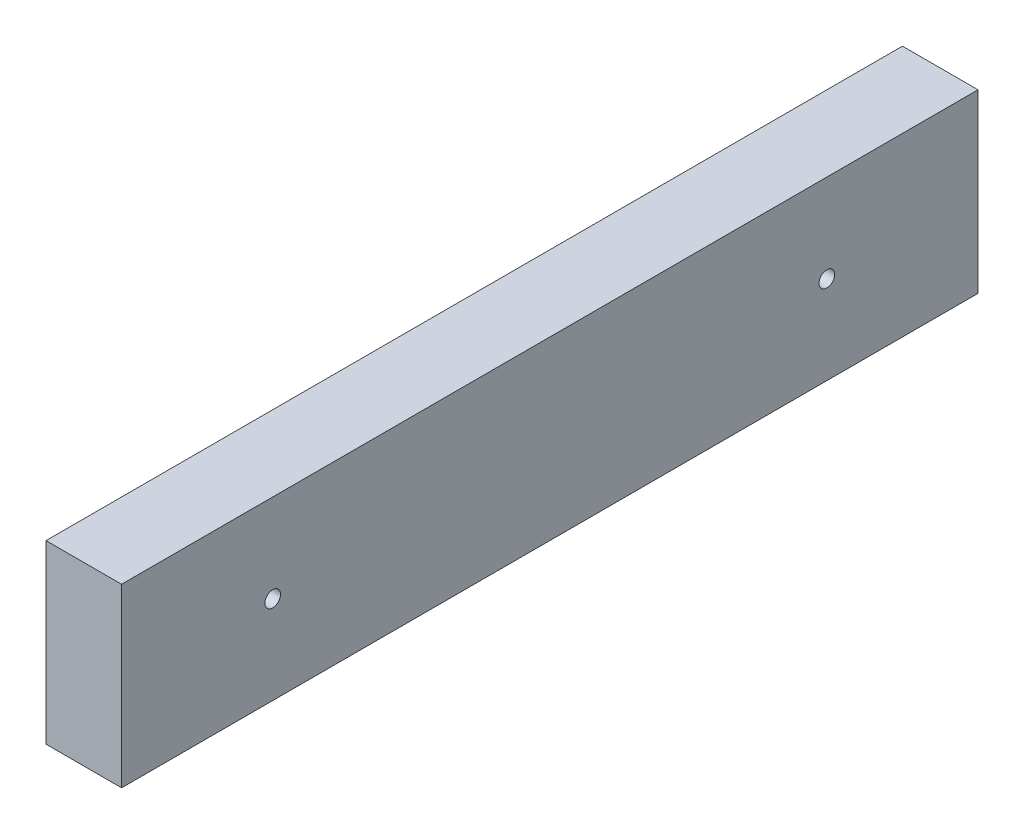
ISO-10303-21;
HEADER;
FILE_DESCRIPTION(('STEP AP214'),'2;1');
FILE_NAME('part.step','',(''),(''),'','','');
FILE_SCHEMA(('AUTOMOTIVE_DESIGN { 1 0 10303 214 1 1 1 1 }'));
ENDSEC;
DATA;
#1=APPLICATION_CONTEXT('core data for automotive mechanical design processes');
#2=APPLICATION_PROTOCOL_DEFINITION('international standard','automotive_design',2000,#1);
#3=PRODUCT_CONTEXT('',#1,'mechanical');
#4=PRODUCT('Part','Part','',(#3));
#5=PRODUCT_RELATED_PRODUCT_CATEGORY('part','',(#4));
#6=PRODUCT_DEFINITION_FORMATION('','',#4);
#7=PRODUCT_DEFINITION_CONTEXT('part definition',#1,'design');
#8=PRODUCT_DEFINITION('design','',#6,#7);
#9=PRODUCT_DEFINITION_SHAPE('','',#8);
#10=(LENGTH_UNIT() NAMED_UNIT(*) SI_UNIT(.MILLI.,.METRE.));
#11=(NAMED_UNIT(*) PLANE_ANGLE_UNIT() SI_UNIT($,.RADIAN.));
#12=(NAMED_UNIT(*) SI_UNIT($,.STERADIAN.) SOLID_ANGLE_UNIT());
#13=UNCERTAINTY_MEASURE_WITH_UNIT(LENGTH_MEASURE(1.E-05),#10,'distance_accuracy_value','');
#14=(GEOMETRIC_REPRESENTATION_CONTEXT(3) GLOBAL_UNCERTAINTY_ASSIGNED_CONTEXT((#13)) GLOBAL_UNIT_ASSIGNED_CONTEXT((#10,
#11,#12)) REPRESENTATION_CONTEXT('',''));
#15=CARTESIAN_POINT('',(0.,0.,0.));
#16=DIRECTION('',(0.,0.,1.));
#17=DIRECTION('',(1.,0.,0.));
#18=AXIS2_PLACEMENT_3D('',#15,#16,#17);
#19=CARTESIAN_POINT('',(19.05,-44.45,431.8));
#20=DIRECTION('',(-1.,0.,0.));
#21=DIRECTION('',(0.,0.,1.));
#22=AXIS2_PLACEMENT_3D('',#19,#20,#21);
#23=PLANE('',#22);
#24=CARTESIAN_POINT('',(19.05,0.,355.6));
#25=DIRECTION('',(1.,0.,0.));
#26=DIRECTION('',(0.,0.,-1.));
#27=AXIS2_PLACEMENT_3D('',#24,#25,#26);
#28=CIRCLE('',#27,3.96875);
#29=CARTESIAN_POINT('',(19.05,0.,351.63125));
#30=VERTEX_POINT('',#29);
#31=EDGE_CURVE('E139',#30,#30,#28,.T.);
#32=ORIENTED_EDGE('',*,*,#31,.F.);
#33=EDGE_LOOP('',(#32));
#34=FACE_BOUND('',#33,.T.);
#35=CARTESIAN_POINT('',(19.05,0.,76.2));
#36=DIRECTION('',(1.,0.,0.));
#37=DIRECTION('',(0.,0.,-1.));
#38=AXIS2_PLACEMENT_3D('',#35,#36,#37);
#39=CIRCLE('',#38,3.96875);
#40=CARTESIAN_POINT('',(19.05,0.,72.23125));
#41=VERTEX_POINT('',#40);
#42=EDGE_CURVE('E131',#41,#41,#39,.T.);
#43=ORIENTED_EDGE('',*,*,#42,.F.);
#44=EDGE_LOOP('',(#43));
#45=FACE_BOUND('',#44,.T.);
#46=DIRECTION('',(0.,1.,0.));
#47=VECTOR('',#46,1.);
#48=CARTESIAN_POINT('',(19.05,-44.45,0.));
#49=LINE('',#48,#47);
#50=CARTESIAN_POINT('',(19.05,-44.45,0.));
#51=VERTEX_POINT('',#50);
#52=CARTESIAN_POINT('',(19.05,44.45,0.));
#53=VERTEX_POINT('',#52);
#54=EDGE_CURVE('E105',#51,#53,#49,.T.);
#55=ORIENTED_EDGE('',*,*,#54,.T.);
#56=DIRECTION('',(0.,0.,-1.));
#57=VECTOR('',#56,1.);
#58=CARTESIAN_POINT('',(19.05,44.45,431.8));
#59=LINE('',#58,#57);
#60=CARTESIAN_POINT('',(19.05,44.45,431.8));
#61=VERTEX_POINT('',#60);
#62=EDGE_CURVE('E11',#61,#53,#59,.T.);
#63=ORIENTED_EDGE('',*,*,#62,.F.);
#64=DIRECTION('',(0.,1.,0.));
#65=VECTOR('',#64,1.);
#66=CARTESIAN_POINT('',(19.05,-44.45,431.8));
#67=LINE('',#66,#65);
#68=CARTESIAN_POINT('',(19.05,-44.45,431.8));
#69=VERTEX_POINT('',#68);
#70=EDGE_CURVE('E88',#69,#61,#67,.T.);
#71=ORIENTED_EDGE('',*,*,#70,.F.);
#72=DIRECTION('',(0.,0.,-1.));
#73=VECTOR('',#72,1.);
#74=CARTESIAN_POINT('',(19.05,-44.45,431.8));
#75=LINE('',#74,#73);
#76=EDGE_CURVE('E101',#69,#51,#75,.T.);
#77=ORIENTED_EDGE('',*,*,#76,.T.);
#78=EDGE_LOOP('',(#55,#63,#71,#77));
#79=FACE_BOUND('',#78,.T.);
#80=ADVANCED_FACE('F36',(#34,#45,#79),#23,.F.);
#81=CARTESIAN_POINT('',(-19.05,44.45,431.8));
#82=DIRECTION('',(0.,-1.,0.));
#83=DIRECTION('',(0.,0.,-1.));
#84=AXIS2_PLACEMENT_3D('',#81,#82,#83);
#85=PLANE('',#84);
#86=DIRECTION('',(-1.,0.,0.));
#87=VECTOR('',#86,1.);
#88=CARTESIAN_POINT('',(-19.05,44.45,0.));
#89=LINE('',#88,#87);
#90=CARTESIAN_POINT('',(-19.05,44.45,0.));
#91=VERTEX_POINT('',#90);
#92=EDGE_CURVE('E93',#53,#91,#89,.T.);
#93=ORIENTED_EDGE('',*,*,#92,.T.);
#94=DIRECTION('',(0.,0.,-1.));
#95=VECTOR('',#94,1.);
#96=CARTESIAN_POINT('',(-19.05,44.45,431.8));
#97=LINE('',#96,#95);
#98=CARTESIAN_POINT('',(-19.05,44.45,431.8));
#99=VERTEX_POINT('',#98);
#100=EDGE_CURVE('E45',#99,#91,#97,.T.);
#101=ORIENTED_EDGE('',*,*,#100,.F.);
#102=DIRECTION('',(-1.,0.,0.));
#103=VECTOR('',#102,1.);
#104=CARTESIAN_POINT('',(-19.05,44.45,431.8));
#105=LINE('',#104,#103);
#106=EDGE_CURVE('E83',#61,#99,#105,.T.);
#107=ORIENTED_EDGE('',*,*,#106,.F.);
#108=ORIENTED_EDGE('',*,*,#62,.T.);
#109=EDGE_LOOP('',(#93,#101,#107,#108));
#110=FACE_BOUND('',#109,.T.);
#111=ADVANCED_FACE('F92',(#110),#85,.F.);
#112=CARTESIAN_POINT('',(-19.05,-44.45,431.8));
#113=DIRECTION('',(1.,0.,0.));
#114=DIRECTION('',(0.,0.,-1.));
#115=AXIS2_PLACEMENT_3D('',#112,#113,#114);
#116=PLANE('',#115);
#117=CARTESIAN_POINT('',(-19.05,0.,355.6));
#118=DIRECTION('',(1.,0.,0.));
#119=DIRECTION('',(0.,0.,-1.));
#120=AXIS2_PLACEMENT_3D('',#117,#118,#119);
#121=CIRCLE('',#120,3.96874999999999);
#122=CARTESIAN_POINT('',(-19.05,0.,351.63125));
#123=VERTEX_POINT('',#122);
#124=EDGE_CURVE('E135',#123,#123,#121,.T.);
#125=ORIENTED_EDGE('',*,*,#124,.T.);
#126=EDGE_LOOP('',(#125));
#127=FACE_BOUND('',#126,.T.);
#128=CARTESIAN_POINT('',(-19.05,0.,76.2));
#129=DIRECTION('',(1.,0.,0.));
#130=DIRECTION('',(0.,0.,-1.));
#131=AXIS2_PLACEMENT_3D('',#128,#129,#130);
#132=CIRCLE('',#131,3.96874999999999);
#133=CARTESIAN_POINT('',(-19.05,0.,72.23125));
#134=VERTEX_POINT('',#133);
#135=EDGE_CURVE('E109',#134,#134,#132,.T.);
#136=ORIENTED_EDGE('',*,*,#135,.T.);
#137=EDGE_LOOP('',(#136));
#138=FACE_BOUND('',#137,.T.);
#139=DIRECTION('',(0.,-1.,0.));
#140=VECTOR('',#139,1.);
#141=CARTESIAN_POINT('',(-19.05,-44.45,0.));
#142=LINE('',#141,#140);
#143=CARTESIAN_POINT('',(-19.05,-44.45,0.));
#144=VERTEX_POINT('',#143);
#145=EDGE_CURVE('E70',#91,#144,#142,.T.);
#146=ORIENTED_EDGE('',*,*,#145,.T.);
#147=DIRECTION('',(0.,0.,-1.));
#148=VECTOR('',#147,1.);
#149=CARTESIAN_POINT('',(-19.05,-44.45,431.8));
#150=LINE('',#149,#148);
#151=CARTESIAN_POINT('',(-19.05,-44.45,431.8));
#152=VERTEX_POINT('',#151);
#153=EDGE_CURVE('E95',#152,#144,#150,.T.);
#154=ORIENTED_EDGE('',*,*,#153,.F.);
#155=DIRECTION('',(0.,-1.,0.));
#156=VECTOR('',#155,1.);
#157=CARTESIAN_POINT('',(-19.05,-44.45,431.8));
#158=LINE('',#157,#156);
#159=EDGE_CURVE('E86',#99,#152,#158,.T.);
#160=ORIENTED_EDGE('',*,*,#159,.F.);
#161=ORIENTED_EDGE('',*,*,#100,.T.);
#162=EDGE_LOOP('',(#146,#154,#160,#161));
#163=FACE_BOUND('',#162,.T.);
#164=ADVANCED_FACE('F96',(#127,#138,#163),#116,.F.);
#165=CARTESIAN_POINT('',(-19.05,-44.45,431.8));
#166=DIRECTION('',(0.,1.,0.));
#167=DIRECTION('',(0.,0.,1.));
#168=AXIS2_PLACEMENT_3D('',#165,#166,#167);
#169=PLANE('',#168);
#170=DIRECTION('',(1.,0.,0.));
#171=VECTOR('',#170,1.);
#172=CARTESIAN_POINT('',(-19.05,-44.45,0.));
#173=LINE('',#172,#171);
#174=EDGE_CURVE('E76',#144,#51,#173,.T.);
#175=ORIENTED_EDGE('',*,*,#174,.T.);
#176=ORIENTED_EDGE('',*,*,#76,.F.);
#177=DIRECTION('',(1.,0.,0.));
#178=VECTOR('',#177,1.);
#179=CARTESIAN_POINT('',(-19.05,-44.45,431.8));
#180=LINE('',#179,#178);
#181=EDGE_CURVE('E53',#152,#69,#180,.T.);
#182=ORIENTED_EDGE('',*,*,#181,.F.);
#183=ORIENTED_EDGE('',*,*,#153,.T.);
#184=EDGE_LOOP('',(#175,#176,#182,#183));
#185=FACE_BOUND('',#184,.T.);
#186=ADVANCED_FACE('F120',(#185),#169,.F.);
#187=CARTESIAN_POINT('',(0.,0.,431.8));
#188=DIRECTION('',(0.,0.,-1.));
#189=DIRECTION('',(-1.,0.,0.));
#190=AXIS2_PLACEMENT_3D('',#187,#188,#189);
#191=PLANE('',#190);
#192=ORIENTED_EDGE('',*,*,#70,.T.);
#193=ORIENTED_EDGE('',*,*,#106,.T.);
#194=ORIENTED_EDGE('',*,*,#159,.T.);
#195=ORIENTED_EDGE('',*,*,#181,.T.);
#196=EDGE_LOOP('',(#192,#193,#194,#195));
#197=FACE_BOUND('',#196,.T.);
#198=ADVANCED_FACE('F84',(#197),#191,.F.);
#199=CARTESIAN_POINT('',(0.,0.,0.));
#200=DIRECTION('',(0.,0.,-1.));
#201=DIRECTION('',(-1.,0.,0.));
#202=AXIS2_PLACEMENT_3D('',#199,#200,#201);
#203=PLANE('',#202);
#204=ORIENTED_EDGE('',*,*,#54,.F.);
#205=ORIENTED_EDGE('',*,*,#174,.F.);
#206=ORIENTED_EDGE('',*,*,#145,.F.);
#207=ORIENTED_EDGE('',*,*,#92,.F.);
#208=EDGE_LOOP('',(#204,#205,#206,#207));
#209=FACE_BOUND('',#208,.T.);
#210=ADVANCED_FACE('F123',(#209),#203,.T.);
#211=CARTESIAN_POINT('',(19.05,0.,76.2));
#212=DIRECTION('',(1.,0.,0.));
#213=DIRECTION('',(0.,0.,-1.));
#214=AXIS2_PLACEMENT_3D('',#211,#212,#213);
#215=CYLINDRICAL_SURFACE('',#214,3.96874999999999);
#216=ORIENTED_EDGE('',*,*,#135,.F.);
#217=EDGE_LOOP('',(#216));
#218=FACE_BOUND('',#217,.T.);
#219=ORIENTED_EDGE('',*,*,#42,.T.);
#220=EDGE_LOOP('',(#219));
#221=FACE_BOUND('',#220,.T.);
#222=ADVANCED_FACE('F151',(#218,#221),#215,.F.);
#223=CARTESIAN_POINT('',(19.05,0.,355.6));
#224=DIRECTION('',(1.,0.,0.));
#225=DIRECTION('',(0.,0.,-1.));
#226=AXIS2_PLACEMENT_3D('',#223,#224,#225);
#227=CYLINDRICAL_SURFACE('',#226,3.96874999999999);
#228=ORIENTED_EDGE('',*,*,#124,.F.);
#229=EDGE_LOOP('',(#228));
#230=FACE_BOUND('',#229,.T.);
#231=ORIENTED_EDGE('',*,*,#31,.T.);
#232=EDGE_LOOP('',(#231));
#233=FACE_BOUND('',#232,.T.);
#234=ADVANCED_FACE('F145',(#230,#233),#227,.F.);
#235=CLOSED_SHELL('',(#80,#111,#164,#186,#198,#210,#222,#234));
#236=MANIFOLD_SOLID_BREP('B2',#235);
#237=ADVANCED_BREP_SHAPE_REPRESENTATION('',(#18,#236),#14);
#238=SHAPE_DEFINITION_REPRESENTATION(#9,#237);
ENDSEC;
END-ISO-10303-21;
